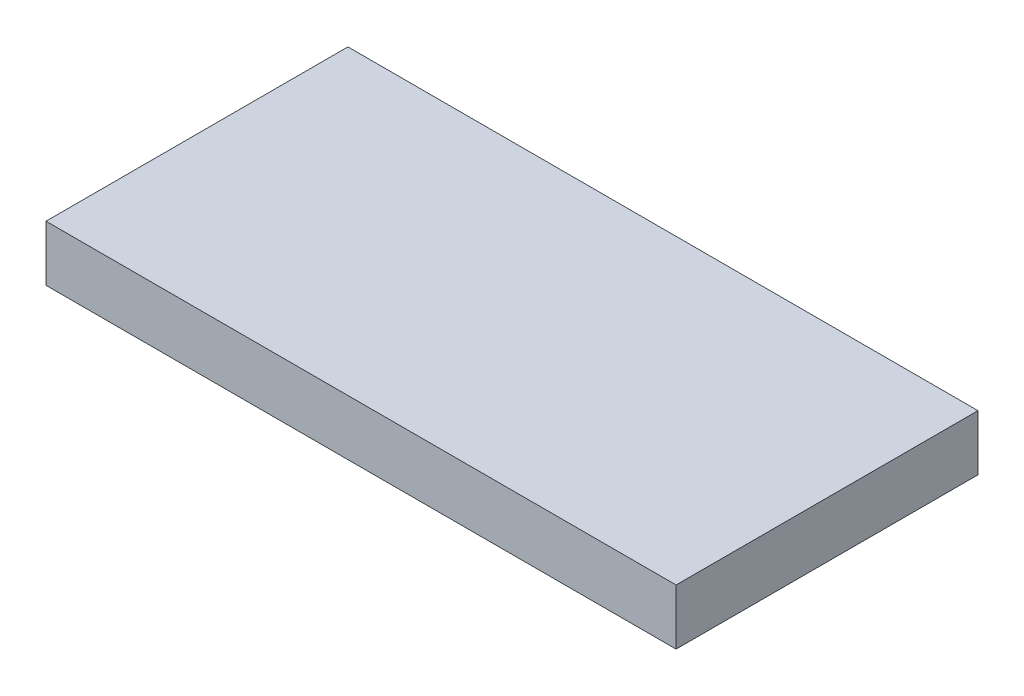
ISO-10303-21;
HEADER;
FILE_DESCRIPTION(('STEP AP214'),'2;1');
FILE_NAME('part.step','',(''),(''),'','','');
FILE_SCHEMA(('AUTOMOTIVE_DESIGN { 1 0 10303 214 1 1 1 1 }'));
ENDSEC;
DATA;
#1=APPLICATION_CONTEXT('core data for automotive mechanical design processes');
#2=APPLICATION_PROTOCOL_DEFINITION('international standard','automotive_design',2000,#1);
#3=PRODUCT_CONTEXT('',#1,'mechanical');
#4=PRODUCT('Part','Part','',(#3));
#5=PRODUCT_RELATED_PRODUCT_CATEGORY('part','',(#4));
#6=PRODUCT_DEFINITION_FORMATION('','',#4);
#7=PRODUCT_DEFINITION_CONTEXT('part definition',#1,'design');
#8=PRODUCT_DEFINITION('design','',#6,#7);
#9=PRODUCT_DEFINITION_SHAPE('','',#8);
#10=(LENGTH_UNIT() NAMED_UNIT(*) SI_UNIT(.MILLI.,.METRE.));
#11=(NAMED_UNIT(*) PLANE_ANGLE_UNIT() SI_UNIT($,.RADIAN.));
#12=(NAMED_UNIT(*) SI_UNIT($,.STERADIAN.) SOLID_ANGLE_UNIT());
#13=UNCERTAINTY_MEASURE_WITH_UNIT(LENGTH_MEASURE(1.E-05),#10,'distance_accuracy_value','');
#14=(GEOMETRIC_REPRESENTATION_CONTEXT(3) GLOBAL_UNCERTAINTY_ASSIGNED_CONTEXT((#13)) GLOBAL_UNIT_ASSIGNED_CONTEXT((#10,
#11,#12)) REPRESENTATION_CONTEXT('',''));
#15=CARTESIAN_POINT('',(0.,0.,0.));
#16=DIRECTION('',(0.,0.,1.));
#17=DIRECTION('',(1.,0.,0.));
#18=AXIS2_PLACEMENT_3D('',#15,#16,#17);
#19=CARTESIAN_POINT('',(0.,-6.36,34.5));
#20=DIRECTION('',(1.,0.,0.));
#21=DIRECTION('',(0.,0.,-1.));
#22=AXIS2_PLACEMENT_3D('',#19,#20,#21);
#23=PLANE('',#22);
#24=DIRECTION('',(0.,-1.,0.));
#25=VECTOR('',#24,1.);
#26=CARTESIAN_POINT('',(0.,6.35,34.5));
#27=LINE('',#26,#25);
#28=CARTESIAN_POINT('',(0.,6.35,34.5));
#29=VERTEX_POINT('',#28);
#30=CARTESIAN_POINT('',(0.,-6.35,34.5));
#31=VERTEX_POINT('',#30);
#32=EDGE_CURVE('E198',#29,#31,#27,.T.);
#33=ORIENTED_EDGE('',*,*,#32,.F.);
#34=DIRECTION('',(0.,0.,-1.));
#35=VECTOR('',#34,1.);
#36=CARTESIAN_POINT('',(0.,6.35,0.));
#37=LINE('',#36,#35);
#38=CARTESIAN_POINT('',(0.,6.35,-34.5));
#39=VERTEX_POINT('',#38);
#40=EDGE_CURVE('E44',#29,#39,#37,.T.);
#41=ORIENTED_EDGE('',*,*,#40,.T.);
#42=DIRECTION('',(0.,1.,0.));
#43=VECTOR('',#42,1.);
#44=CARTESIAN_POINT('',(0.,6.35,-34.5));
#45=LINE('',#44,#43);
#46=CARTESIAN_POINT('',(0.,-6.35,-34.5));
#47=VERTEX_POINT('',#46);
#48=EDGE_CURVE('E201',#47,#39,#45,.T.);
#49=ORIENTED_EDGE('',*,*,#48,.F.);
#50=DIRECTION('',(0.,0.,-1.));
#51=VECTOR('',#50,1.);
#52=CARTESIAN_POINT('',(0.,-6.35,0.));
#53=LINE('',#52,#51);
#54=CARTESIAN_POINT('',(0.,-6.35,-30.95625));
#55=VERTEX_POINT('',#54);
#56=EDGE_CURVE('E210',#55,#47,#53,.T.);
#57=ORIENTED_EDGE('',*,*,#56,.F.);
#58=DIRECTION('',(0.,-1.,0.));
#59=VECTOR('',#58,1.);
#60=CARTESIAN_POINT('',(0.,0.,-30.95625));
#61=LINE('',#60,#59);
#62=CARTESIAN_POINT('',(0.,0.,-30.95625));
#63=VERTEX_POINT('',#62);
#64=EDGE_CURVE('E209',#63,#55,#61,.T.);
#65=ORIENTED_EDGE('',*,*,#64,.F.);
#66=DIRECTION('',(0.,0.,-1.));
#67=VECTOR('',#66,1.);
#68=CARTESIAN_POINT('',(0.,0.,0.));
#69=LINE('',#68,#67);
#70=CARTESIAN_POINT('',(0.,0.,-27.5));
#71=VERTEX_POINT('',#70);
#72=EDGE_CURVE('E203',#71,#63,#69,.T.);
#73=ORIENTED_EDGE('',*,*,#72,.F.);
#74=DIRECTION('',(0.,-1.,0.));
#75=VECTOR('',#74,1.);
#76=CARTESIAN_POINT('',(0.,4.,-27.5));
#77=LINE('',#76,#75);
#78=CARTESIAN_POINT('',(0.,4.,-27.5));
#79=VERTEX_POINT('',#78);
#80=EDGE_CURVE('E205',#79,#71,#77,.T.);
#81=ORIENTED_EDGE('',*,*,#80,.F.);
#82=DIRECTION('',(0.,0.,1.));
#83=VECTOR('',#82,1.);
#84=CARTESIAN_POINT('',(0.,4.,0.));
#85=LINE('',#84,#83);
#86=CARTESIAN_POINT('',(0.,4.,27.5));
#87=VERTEX_POINT('',#86);
#88=EDGE_CURVE('E11',#79,#87,#85,.T.);
#89=ORIENTED_EDGE('',*,*,#88,.T.);
#90=DIRECTION('',(0.,1.,0.));
#91=VECTOR('',#90,1.);
#92=CARTESIAN_POINT('',(0.,4.,27.5));
#93=LINE('',#92,#91);
#94=CARTESIAN_POINT('',(0.,0.,27.5));
#95=VERTEX_POINT('',#94);
#96=EDGE_CURVE('E52',#95,#87,#93,.T.);
#97=ORIENTED_EDGE('',*,*,#96,.F.);
#98=CARTESIAN_POINT('',(0.,0.,30.95625));
#99=VERTEX_POINT('',#98);
#100=EDGE_CURVE('E197',#99,#95,#69,.T.);
#101=ORIENTED_EDGE('',*,*,#100,.F.);
#102=DIRECTION('',(0.,1.,0.));
#103=VECTOR('',#102,1.);
#104=CARTESIAN_POINT('',(0.,0.,30.95625));
#105=LINE('',#104,#103);
#106=CARTESIAN_POINT('',(0.,-6.35,30.95625));
#107=VERTEX_POINT('',#106);
#108=EDGE_CURVE('E207',#107,#99,#105,.T.);
#109=ORIENTED_EDGE('',*,*,#108,.F.);
#110=EDGE_CURVE('E39',#31,#107,#53,.T.);
#111=ORIENTED_EDGE('',*,*,#110,.F.);
#112=EDGE_LOOP('',(#33,#41,#49,#57,#65,#73,#81,#89,#97,#101,#109,#111));
#113=FACE_BOUND('',#112,.T.);
#114=ADVANCED_FACE('F36',(#113),#23,.F.);
#115=CARTESIAN_POINT('',(0.,0.,0.));
#116=DIRECTION('',(0.,1.,0.));
#117=DIRECTION('',(0.,0.,1.));
#118=AXIS2_PLACEMENT_3D('',#115,#116,#117);
#119=PLANE('',#118);
#120=DIRECTION('',(-1.,0.,0.));
#121=VECTOR('',#120,1.);
#122=CARTESIAN_POINT('',(-140.096875,0.,30.95625));
#123=LINE('',#122,#121);
#124=CARTESIAN_POINT('',(140.096875,0.,30.95625));
#125=VERTEX_POINT('',#124);
#126=EDGE_CURVE('E156',#125,#99,#123,.T.);
#127=ORIENTED_EDGE('',*,*,#126,.T.);
#128=ORIENTED_EDGE('',*,*,#100,.T.);
#129=DIRECTION('',(-1.,0.,0.));
#130=VECTOR('',#129,1.);
#131=CARTESIAN_POINT('',(-135.675,0.,27.5));
#132=LINE('',#131,#130);
#133=CARTESIAN_POINT('',(135.675,0.,27.5));
#134=VERTEX_POINT('',#133);
#135=EDGE_CURVE('E145',#134,#95,#132,.T.);
#136=ORIENTED_EDGE('',*,*,#135,.F.);
#137=DIRECTION('',(0.,0.,1.));
#138=VECTOR('',#137,1.);
#139=CARTESIAN_POINT('',(135.675,0.,27.5));
#140=LINE('',#139,#138);
#141=CARTESIAN_POINT('',(135.675,0.,-27.5));
#142=VERTEX_POINT('',#141);
#143=EDGE_CURVE('E132',#142,#134,#140,.T.);
#144=ORIENTED_EDGE('',*,*,#143,.F.);
#145=DIRECTION('',(1.,0.,0.));
#146=VECTOR('',#145,1.);
#147=CARTESIAN_POINT('',(-135.675,0.,-27.5));
#148=LINE('',#147,#146);
#149=EDGE_CURVE('E143',#71,#142,#148,.T.);
#150=ORIENTED_EDGE('',*,*,#149,.F.);
#151=ORIENTED_EDGE('',*,*,#72,.T.);
#152=DIRECTION('',(1.,0.,0.));
#153=VECTOR('',#152,1.);
#154=CARTESIAN_POINT('',(-140.096875,0.,-30.95625));
#155=LINE('',#154,#153);
#156=CARTESIAN_POINT('',(140.096875,0.,-30.95625));
#157=VERTEX_POINT('',#156);
#158=EDGE_CURVE('E160',#63,#157,#155,.T.);
#159=ORIENTED_EDGE('',*,*,#158,.T.);
#160=DIRECTION('',(0.,0.,1.));
#161=VECTOR('',#160,1.);
#162=CARTESIAN_POINT('',(140.096875,0.,-30.95625));
#163=LINE('',#162,#161);
#164=EDGE_CURVE('E153',#157,#125,#163,.T.);
#165=ORIENTED_EDGE('',*,*,#164,.T.);
#166=EDGE_LOOP('',(#127,#128,#136,#144,#150,#151,#159,#165));
#167=FACE_BOUND('',#166,.T.);
#168=ADVANCED_FACE('F236',(#167),#119,.F.);
#169=CARTESIAN_POINT('',(144.,6.35,-34.5));
#170=DIRECTION('',(-1.,0.,0.));
#171=DIRECTION('',(0.,0.,1.));
#172=AXIS2_PLACEMENT_3D('',#169,#170,#171);
#173=PLANE('',#172);
#174=DIRECTION('',(0.,0.,-1.));
#175=VECTOR('',#174,1.);
#176=CARTESIAN_POINT('',(144.,-6.35,-34.5));
#177=LINE('',#176,#175);
#178=CARTESIAN_POINT('',(144.,-6.35,34.5));
#179=VERTEX_POINT('',#178);
#180=CARTESIAN_POINT('',(144.,-6.35,-34.5));
#181=VERTEX_POINT('',#180);
#182=EDGE_CURVE('E171',#179,#181,#177,.T.);
#183=ORIENTED_EDGE('',*,*,#182,.T.);
#184=DIRECTION('',(0.,-1.,0.));
#185=VECTOR('',#184,1.);
#186=CARTESIAN_POINT('',(144.,6.35,-34.5));
#187=LINE('',#186,#185);
#188=CARTESIAN_POINT('',(144.,6.35,-34.5));
#189=VERTEX_POINT('',#188);
#190=EDGE_CURVE('E192',#189,#181,#187,.T.);
#191=ORIENTED_EDGE('',*,*,#190,.F.);
#192=DIRECTION('',(0.,0.,-1.));
#193=VECTOR('',#192,1.);
#194=CARTESIAN_POINT('',(144.,6.35,-34.5));
#195=LINE('',#194,#193);
#196=CARTESIAN_POINT('',(144.,6.35,34.5));
#197=VERTEX_POINT('',#196);
#198=EDGE_CURVE('E174',#197,#189,#195,.T.);
#199=ORIENTED_EDGE('',*,*,#198,.F.);
#200=DIRECTION('',(0.,-1.,0.));
#201=VECTOR('',#200,1.);
#202=CARTESIAN_POINT('',(144.,6.35,34.5));
#203=LINE('',#202,#201);
#204=EDGE_CURVE('E183',#197,#179,#203,.T.);
#205=ORIENTED_EDGE('',*,*,#204,.T.);
#206=EDGE_LOOP('',(#183,#191,#199,#205));
#207=FACE_BOUND('',#206,.T.);
#208=ADVANCED_FACE('F243',(#207),#173,.F.);
#209=CARTESIAN_POINT('',(-144.,6.35,-34.5));
#210=DIRECTION('',(0.,0.,1.));
#211=DIRECTION('',(1.,0.,0.));
#212=AXIS2_PLACEMENT_3D('',#209,#210,#211);
#213=PLANE('',#212);
#214=DIRECTION('',(-1.,0.,0.));
#215=VECTOR('',#214,1.);
#216=CARTESIAN_POINT('',(-144.,-6.35,-34.5));
#217=LINE('',#216,#215);
#218=EDGE_CURVE('E186',#181,#47,#217,.T.);
#219=ORIENTED_EDGE('',*,*,#218,.T.);
#220=ORIENTED_EDGE('',*,*,#48,.T.);
#221=DIRECTION('',(-1.,0.,0.));
#222=VECTOR('',#221,1.);
#223=CARTESIAN_POINT('',(-144.,6.35,-34.5));
#224=LINE('',#223,#222);
#225=EDGE_CURVE('E177',#189,#39,#224,.T.);
#226=ORIENTED_EDGE('',*,*,#225,.F.);
#227=ORIENTED_EDGE('',*,*,#190,.T.);
#228=EDGE_LOOP('',(#219,#220,#226,#227));
#229=FACE_BOUND('',#228,.T.);
#230=ADVANCED_FACE('F240',(#229),#213,.F.);
#231=CARTESIAN_POINT('',(-144.,6.35,34.5));
#232=DIRECTION('',(0.,0.,-1.));
#233=DIRECTION('',(-1.,0.,0.));
#234=AXIS2_PLACEMENT_3D('',#231,#232,#233);
#235=PLANE('',#234);
#236=DIRECTION('',(1.,0.,0.));
#237=VECTOR('',#236,1.);
#238=CARTESIAN_POINT('',(-144.,6.35,34.5));
#239=LINE('',#238,#237);
#240=EDGE_CURVE('E181',#29,#197,#239,.T.);
#241=ORIENTED_EDGE('',*,*,#240,.F.);
#242=ORIENTED_EDGE('',*,*,#32,.T.);
#243=DIRECTION('',(1.,0.,0.));
#244=VECTOR('',#243,1.);
#245=CARTESIAN_POINT('',(-144.,-6.35,34.5));
#246=LINE('',#245,#244);
#247=EDGE_CURVE('E178',#31,#179,#246,.T.);
#248=ORIENTED_EDGE('',*,*,#247,.T.);
#249=ORIENTED_EDGE('',*,*,#204,.F.);
#250=EDGE_LOOP('',(#241,#242,#248,#249));
#251=FACE_BOUND('',#250,.T.);
#252=ADVANCED_FACE('F248',(#251),#235,.F.);
#253=CARTESIAN_POINT('',(0.,6.35,0.));
#254=DIRECTION('',(0.,1.,0.));
#255=DIRECTION('',(0.,0.,1.));
#256=AXIS2_PLACEMENT_3D('',#253,#254,#255);
#257=PLANE('',#256);
#258=ORIENTED_EDGE('',*,*,#40,.F.);
#259=ORIENTED_EDGE('',*,*,#240,.T.);
#260=ORIENTED_EDGE('',*,*,#198,.T.);
#261=ORIENTED_EDGE('',*,*,#225,.T.);
#262=EDGE_LOOP('',(#258,#259,#260,#261));
#263=FACE_BOUND('',#262,.T.);
#264=ADVANCED_FACE('F250',(#263),#257,.T.);
#265=CARTESIAN_POINT('',(0.,-6.35,0.));
#266=DIRECTION('',(0.,1.,0.));
#267=DIRECTION('',(0.,0.,1.));
#268=AXIS2_PLACEMENT_3D('',#265,#266,#267);
#269=PLANE('',#268);
#270=ORIENTED_EDGE('',*,*,#247,.F.);
#271=ORIENTED_EDGE('',*,*,#110,.T.);
#272=DIRECTION('',(-1.,0.,0.));
#273=VECTOR('',#272,1.);
#274=CARTESIAN_POINT('',(-140.096875,-6.35,30.95625));
#275=LINE('',#274,#273);
#276=CARTESIAN_POINT('',(140.096875,-6.35,30.95625));
#277=VERTEX_POINT('',#276);
#278=EDGE_CURVE('E164',#277,#107,#275,.T.);
#279=ORIENTED_EDGE('',*,*,#278,.F.);
#280=DIRECTION('',(0.,0.,1.));
#281=VECTOR('',#280,1.);
#282=CARTESIAN_POINT('',(140.096875,-6.35,-30.95625));
#283=LINE('',#282,#281);
#284=CARTESIAN_POINT('',(140.096875,-6.35,-30.95625));
#285=VERTEX_POINT('',#284);
#286=EDGE_CURVE('E151',#285,#277,#283,.T.);
#287=ORIENTED_EDGE('',*,*,#286,.F.);
#288=DIRECTION('',(1.,0.,0.));
#289=VECTOR('',#288,1.);
#290=CARTESIAN_POINT('',(-140.096875,-6.35,-30.95625));
#291=LINE('',#290,#289);
#292=EDGE_CURVE('E157',#55,#285,#291,.T.);
#293=ORIENTED_EDGE('',*,*,#292,.F.);
#294=ORIENTED_EDGE('',*,*,#56,.T.);
#295=ORIENTED_EDGE('',*,*,#218,.F.);
#296=ORIENTED_EDGE('',*,*,#182,.F.);
#297=EDGE_LOOP('',(#270,#271,#279,#287,#293,#294,#295,#296));
#298=FACE_BOUND('',#297,.T.);
#299=ADVANCED_FACE('F221',(#298),#269,.F.);
#300=CARTESIAN_POINT('',(140.096875,0.,-30.95625));
#301=DIRECTION('',(1.,0.,0.));
#302=DIRECTION('',(0.,0.,-1.));
#303=AXIS2_PLACEMENT_3D('',#300,#301,#302);
#304=PLANE('',#303);
#305=ORIENTED_EDGE('',*,*,#286,.T.);
#306=DIRECTION('',(0.,-1.,0.));
#307=VECTOR('',#306,1.);
#308=CARTESIAN_POINT('',(140.096875,0.,30.95625));
#309=LINE('',#308,#307);
#310=EDGE_CURVE('E162',#125,#277,#309,.T.);
#311=ORIENTED_EDGE('',*,*,#310,.F.);
#312=ORIENTED_EDGE('',*,*,#164,.F.);
#313=DIRECTION('',(0.,-1.,0.));
#314=VECTOR('',#313,1.);
#315=CARTESIAN_POINT('',(140.096875,0.,-30.95625));
#316=LINE('',#315,#314);
#317=EDGE_CURVE('E168',#157,#285,#316,.T.);
#318=ORIENTED_EDGE('',*,*,#317,.T.);
#319=EDGE_LOOP('',(#305,#311,#312,#318));
#320=FACE_BOUND('',#319,.T.);
#321=ADVANCED_FACE('F232',(#320),#304,.F.);
#322=CARTESIAN_POINT('',(-140.096875,0.,-30.95625));
#323=DIRECTION('',(0.,0.,-1.));
#324=DIRECTION('',(-1.,0.,0.));
#325=AXIS2_PLACEMENT_3D('',#322,#323,#324);
#326=PLANE('',#325);
#327=ORIENTED_EDGE('',*,*,#158,.F.);
#328=ORIENTED_EDGE('',*,*,#64,.T.);
#329=ORIENTED_EDGE('',*,*,#292,.T.);
#330=ORIENTED_EDGE('',*,*,#317,.F.);
#331=EDGE_LOOP('',(#327,#328,#329,#330));
#332=FACE_BOUND('',#331,.T.);
#333=ADVANCED_FACE('F234',(#332),#326,.F.);
#334=CARTESIAN_POINT('',(-140.096875,0.,30.95625));
#335=DIRECTION('',(0.,0.,1.));
#336=DIRECTION('',(1.,0.,0.));
#337=AXIS2_PLACEMENT_3D('',#334,#335,#336);
#338=PLANE('',#337);
#339=ORIENTED_EDGE('',*,*,#278,.T.);
#340=ORIENTED_EDGE('',*,*,#108,.T.);
#341=ORIENTED_EDGE('',*,*,#126,.F.);
#342=ORIENTED_EDGE('',*,*,#310,.T.);
#343=EDGE_LOOP('',(#339,#340,#341,#342));
#344=FACE_BOUND('',#343,.T.);
#345=ADVANCED_FACE('F229',(#344),#338,.F.);
#346=CARTESIAN_POINT('',(135.675,4.,27.5));
#347=DIRECTION('',(1.,0.,0.));
#348=DIRECTION('',(0.,0.,-1.));
#349=AXIS2_PLACEMENT_3D('',#346,#347,#348);
#350=PLANE('',#349);
#351=ORIENTED_EDGE('',*,*,#143,.T.);
#352=DIRECTION('',(0.,-1.,0.));
#353=VECTOR('',#352,1.);
#354=CARTESIAN_POINT('',(135.675,4.,27.5));
#355=LINE('',#354,#353);
#356=CARTESIAN_POINT('',(135.675,4.,27.5));
#357=VERTEX_POINT('',#356);
#358=EDGE_CURVE('E126',#357,#134,#355,.T.);
#359=ORIENTED_EDGE('',*,*,#358,.F.);
#360=DIRECTION('',(0.,0.,1.));
#361=VECTOR('',#360,1.);
#362=CARTESIAN_POINT('',(135.675,4.,27.5));
#363=LINE('',#362,#361);
#364=CARTESIAN_POINT('',(135.675,4.,-27.5));
#365=VERTEX_POINT('',#364);
#366=EDGE_CURVE('E130',#365,#357,#363,.T.);
#367=ORIENTED_EDGE('',*,*,#366,.F.);
#368=DIRECTION('',(0.,-1.,0.));
#369=VECTOR('',#368,1.);
#370=CARTESIAN_POINT('',(135.675,4.,-27.5));
#371=LINE('',#370,#369);
#372=EDGE_CURVE('E134',#365,#142,#371,.T.);
#373=ORIENTED_EDGE('',*,*,#372,.T.);
#374=EDGE_LOOP('',(#351,#359,#367,#373));
#375=FACE_BOUND('',#374,.T.);
#376=ADVANCED_FACE('F127',(#375),#350,.F.);
#377=CARTESIAN_POINT('',(-135.675,4.,-27.5));
#378=DIRECTION('',(0.,0.,-1.));
#379=DIRECTION('',(-1.,0.,0.));
#380=AXIS2_PLACEMENT_3D('',#377,#378,#379);
#381=PLANE('',#380);
#382=DIRECTION('',(1.,0.,0.));
#383=VECTOR('',#382,1.);
#384=CARTESIAN_POINT('',(-135.675,4.,-27.5));
#385=LINE('',#384,#383);
#386=EDGE_CURVE('E135',#79,#365,#385,.T.);
#387=ORIENTED_EDGE('',*,*,#386,.F.);
#388=ORIENTED_EDGE('',*,*,#80,.T.);
#389=ORIENTED_EDGE('',*,*,#149,.T.);
#390=ORIENTED_EDGE('',*,*,#372,.F.);
#391=EDGE_LOOP('',(#387,#388,#389,#390));
#392=FACE_BOUND('',#391,.T.);
#393=ADVANCED_FACE('F270',(#392),#381,.F.);
#394=CARTESIAN_POINT('',(-135.675,4.,27.5));
#395=DIRECTION('',(0.,0.,1.));
#396=DIRECTION('',(1.,0.,0.));
#397=AXIS2_PLACEMENT_3D('',#394,#395,#396);
#398=PLANE('',#397);
#399=ORIENTED_EDGE('',*,*,#135,.T.);
#400=ORIENTED_EDGE('',*,*,#96,.T.);
#401=DIRECTION('',(-1.,0.,0.));
#402=VECTOR('',#401,1.);
#403=CARTESIAN_POINT('',(-135.675,4.,27.5));
#404=LINE('',#403,#402);
#405=EDGE_CURVE('E137',#357,#87,#404,.T.);
#406=ORIENTED_EDGE('',*,*,#405,.F.);
#407=ORIENTED_EDGE('',*,*,#358,.T.);
#408=EDGE_LOOP('',(#399,#400,#406,#407));
#409=FACE_BOUND('',#408,.T.);
#410=ADVANCED_FACE('F138',(#409),#398,.F.);
#411=CARTESIAN_POINT('',(0.,4.,0.));
#412=DIRECTION('',(0.,-1.,0.));
#413=DIRECTION('',(0.,0.,-1.));
#414=AXIS2_PLACEMENT_3D('',#411,#412,#413);
#415=PLANE('',#414);
#416=ORIENTED_EDGE('',*,*,#88,.F.);
#417=ORIENTED_EDGE('',*,*,#386,.T.);
#418=ORIENTED_EDGE('',*,*,#366,.T.);
#419=ORIENTED_EDGE('',*,*,#405,.T.);
#420=EDGE_LOOP('',(#416,#417,#418,#419));
#421=FACE_BOUND('',#420,.T.);
#422=ADVANCED_FACE('F140',(#421),#415,.T.);
#423=CLOSED_SHELL('',(#114,#168,#208,#230,#252,#264,#299,#321,#333,#345,#376,#393,#410,#422));
#424=MANIFOLD_SOLID_BREP('B2',#423);
#425=ADVANCED_BREP_SHAPE_REPRESENTATION('',(#18,#424),#14);
#426=SHAPE_DEFINITION_REPRESENTATION(#9,#425);
ENDSEC;
END-ISO-10303-21;
